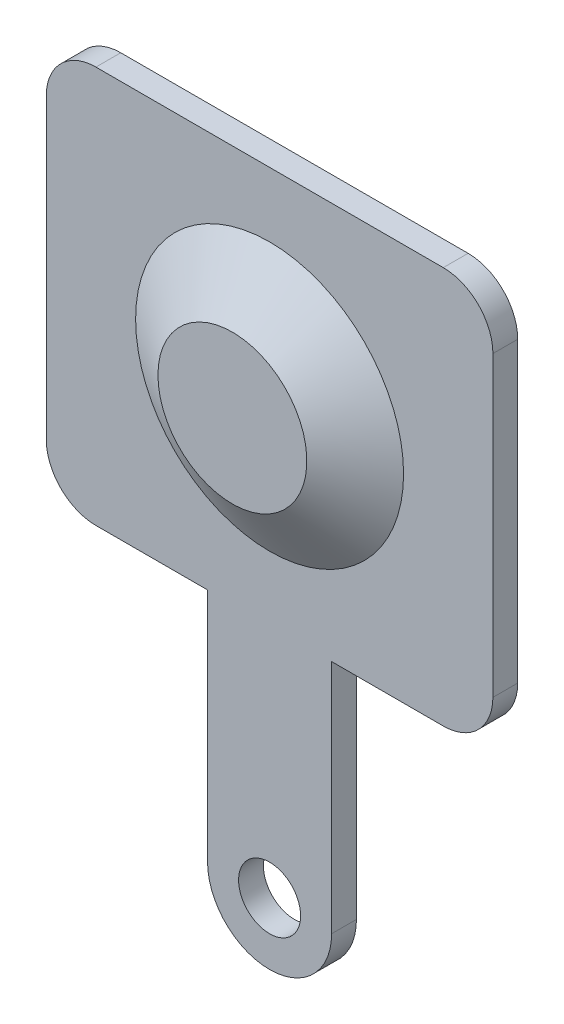
ISO-10303-21;
HEADER;
FILE_DESCRIPTION(('STEP AP214'),'2;1');
FILE_NAME('part.step','',(''),(''),'','','');
FILE_SCHEMA(('AUTOMOTIVE_DESIGN { 1 0 10303 214 1 1 1 1 }'));
ENDSEC;
DATA;
#1=APPLICATION_CONTEXT('core data for automotive mechanical design processes');
#2=APPLICATION_PROTOCOL_DEFINITION('international standard','automotive_design',2000,#1);
#3=PRODUCT_CONTEXT('',#1,'mechanical');
#4=PRODUCT('Part','Part','',(#3));
#5=PRODUCT_RELATED_PRODUCT_CATEGORY('part','',(#4));
#6=PRODUCT_DEFINITION_FORMATION('','',#4);
#7=PRODUCT_DEFINITION_CONTEXT('part definition',#1,'design');
#8=PRODUCT_DEFINITION('design','',#6,#7);
#9=PRODUCT_DEFINITION_SHAPE('','',#8);
#10=(LENGTH_UNIT() NAMED_UNIT(*) SI_UNIT(.MILLI.,.METRE.));
#11=(NAMED_UNIT(*) PLANE_ANGLE_UNIT() SI_UNIT($,.RADIAN.));
#12=(NAMED_UNIT(*) SI_UNIT($,.STERADIAN.) SOLID_ANGLE_UNIT());
#13=UNCERTAINTY_MEASURE_WITH_UNIT(LENGTH_MEASURE(1.E-05),#10,'distance_accuracy_value','');
#14=(GEOMETRIC_REPRESENTATION_CONTEXT(3) GLOBAL_UNCERTAINTY_ASSIGNED_CONTEXT((#13)) GLOBAL_UNIT_ASSIGNED_CONTEXT((#10,
#11,#12)) REPRESENTATION_CONTEXT('',''));
#15=CARTESIAN_POINT('',(0.,0.,0.));
#16=DIRECTION('',(0.,0.,1.));
#17=DIRECTION('',(1.,0.,0.));
#18=AXIS2_PLACEMENT_3D('',#15,#16,#17);
#19=CARTESIAN_POINT('',(-4.5,-4.,0.5));
#20=DIRECTION('',(0.,1.,0.));
#21=DIRECTION('',(0.,0.,1.));
#22=AXIS2_PLACEMENT_3D('',#19,#20,#21);
#23=PLANE('',#22);
#24=DIRECTION('',(1.,0.,0.));
#25=VECTOR('',#24,1.);
#26=CARTESIAN_POINT('',(-4.5,-4.,0.));
#27=LINE('',#26,#25);
#28=CARTESIAN_POINT('',(1.25,-4.,0.));
#29=VERTEX_POINT('',#28);
#30=CARTESIAN_POINT('',(3.5,-4.,0.));
#31=VERTEX_POINT('',#30);
#32=EDGE_CURVE('E184',#29,#31,#27,.T.);
#33=ORIENTED_EDGE('',*,*,#32,.T.);
#34=DIRECTION('',(0.,0.,-1.));
#35=VECTOR('',#34,1.);
#36=CARTESIAN_POINT('',(3.5,-4.,0.5));
#37=LINE('',#36,#35);
#38=CARTESIAN_POINT('',(3.5,-4.,0.5));
#39=VERTEX_POINT('',#38);
#40=EDGE_CURVE('E214',#31,#39,#37,.F.);
#41=ORIENTED_EDGE('',*,*,#40,.T.);
#42=DIRECTION('',(1.,0.,0.));
#43=VECTOR('',#42,1.);
#44=CARTESIAN_POINT('',(-4.5,-4.,0.5));
#45=LINE('',#44,#43);
#46=CARTESIAN_POINT('',(1.25,-4.,0.5));
#47=VERTEX_POINT('',#46);
#48=EDGE_CURVE('E173',#47,#39,#45,.T.);
#49=ORIENTED_EDGE('',*,*,#48,.F.);
#50=DIRECTION('',(0.,0.,1.));
#51=VECTOR('',#50,1.);
#52=CARTESIAN_POINT('',(1.25,-4.,0.5));
#53=LINE('',#52,#51);
#54=EDGE_CURVE('E159',#29,#47,#53,.T.);
#55=ORIENTED_EDGE('',*,*,#54,.F.);
#56=EDGE_LOOP('',(#33,#41,#49,#55));
#57=FACE_BOUND('',#56,.T.);
#58=ADVANCED_FACE('F32',(#57),#23,.F.);
#59=CARTESIAN_POINT('',(-3.5,-4.,0.5));
#60=VERTEX_POINT('',#59);
#61=CARTESIAN_POINT('',(-1.25,-4.,0.5));
#62=VERTEX_POINT('',#61);
#63=EDGE_CURVE('E174',#60,#62,#45,.T.);
#64=ORIENTED_EDGE('',*,*,#63,.F.);
#65=DIRECTION('',(0.,0.,-1.));
#66=VECTOR('',#65,1.);
#67=CARTESIAN_POINT('',(-3.5,-4.,0.5));
#68=LINE('',#67,#66);
#69=CARTESIAN_POINT('',(-3.5,-4.,0.));
#70=VERTEX_POINT('',#69);
#71=EDGE_CURVE('E40',#60,#70,#68,.T.);
#72=ORIENTED_EDGE('',*,*,#71,.T.);
#73=CARTESIAN_POINT('',(-1.25,-4.,0.));
#74=VERTEX_POINT('',#73);
#75=EDGE_CURVE('E167',#70,#74,#27,.T.);
#76=ORIENTED_EDGE('',*,*,#75,.T.);
#77=DIRECTION('',(0.,0.,-1.));
#78=VECTOR('',#77,1.);
#79=CARTESIAN_POINT('',(-1.25,-4.,0.5));
#80=LINE('',#79,#78);
#81=EDGE_CURVE('E131',#62,#74,#80,.T.);
#82=ORIENTED_EDGE('',*,*,#81,.F.);
#83=EDGE_LOOP('',(#64,#72,#76,#82));
#84=FACE_BOUND('',#83,.T.);
#85=ADVANCED_FACE('F219',(#84),#23,.F.);
#86=CARTESIAN_POINT('',(4.5,-4.,0.5));
#87=DIRECTION('',(-1.,0.,0.));
#88=DIRECTION('',(0.,0.,1.));
#89=AXIS2_PLACEMENT_3D('',#86,#87,#88);
#90=PLANE('',#89);
#91=DIRECTION('',(0.,1.,0.));
#92=VECTOR('',#91,1.);
#93=CARTESIAN_POINT('',(4.5,-4.,0.));
#94=LINE('',#93,#92);
#95=CARTESIAN_POINT('',(4.5,-3.,0.));
#96=VERTEX_POINT('',#95);
#97=CARTESIAN_POINT('',(4.5,3.,0.));
#98=VERTEX_POINT('',#97);
#99=EDGE_CURVE('E163',#96,#98,#94,.T.);
#100=ORIENTED_EDGE('',*,*,#99,.T.);
#101=DIRECTION('',(0.,0.,-1.));
#102=VECTOR('',#101,1.);
#103=CARTESIAN_POINT('',(4.5,3.,0.5));
#104=LINE('',#103,#102);
#105=CARTESIAN_POINT('',(4.5,3.,0.5));
#106=VERTEX_POINT('',#105);
#107=EDGE_CURVE('E47',#98,#106,#104,.F.);
#108=ORIENTED_EDGE('',*,*,#107,.T.);
#109=DIRECTION('',(0.,1.,0.));
#110=VECTOR('',#109,1.);
#111=CARTESIAN_POINT('',(4.5,-4.,0.5));
#112=LINE('',#111,#110);
#113=CARTESIAN_POINT('',(4.5,-3.,0.5));
#114=VERTEX_POINT('',#113);
#115=EDGE_CURVE('E164',#114,#106,#112,.T.);
#116=ORIENTED_EDGE('',*,*,#115,.F.);
#117=DIRECTION('',(0.,0.,-1.));
#118=VECTOR('',#117,1.);
#119=CARTESIAN_POINT('',(4.5,-3.,0.5));
#120=LINE('',#119,#118);
#121=EDGE_CURVE('E210',#114,#96,#120,.T.);
#122=ORIENTED_EDGE('',*,*,#121,.T.);
#123=EDGE_LOOP('',(#100,#108,#116,#122));
#124=FACE_BOUND('',#123,.T.);
#125=ADVANCED_FACE('F241',(#124),#90,.F.);
#126=CARTESIAN_POINT('',(-4.5,4.,0.5));
#127=DIRECTION('',(0.,-1.,0.));
#128=DIRECTION('',(0.,0.,-1.));
#129=AXIS2_PLACEMENT_3D('',#126,#127,#128);
#130=PLANE('',#129);
#131=DIRECTION('',(-1.,0.,0.));
#132=VECTOR('',#131,1.);
#133=CARTESIAN_POINT('',(-4.5,4.,0.));
#134=LINE('',#133,#132);
#135=CARTESIAN_POINT('',(3.5,4.,0.));
#136=VERTEX_POINT('',#135);
#137=CARTESIAN_POINT('',(-3.5,4.,0.));
#138=VERTEX_POINT('',#137);
#139=EDGE_CURVE('E178',#136,#138,#134,.T.);
#140=ORIENTED_EDGE('',*,*,#139,.T.);
#141=DIRECTION('',(0.,0.,-1.));
#142=VECTOR('',#141,1.);
#143=CARTESIAN_POINT('',(-3.5,4.,0.5));
#144=LINE('',#143,#142);
#145=CARTESIAN_POINT('',(-3.5,4.,0.5));
#146=VERTEX_POINT('',#145);
#147=EDGE_CURVE('E201',#138,#146,#144,.F.);
#148=ORIENTED_EDGE('',*,*,#147,.T.);
#149=DIRECTION('',(-1.,0.,0.));
#150=VECTOR('',#149,1.);
#151=CARTESIAN_POINT('',(-4.5,4.,0.5));
#152=LINE('',#151,#150);
#153=CARTESIAN_POINT('',(3.5,4.,0.5));
#154=VERTEX_POINT('',#153);
#155=EDGE_CURVE('E166',#154,#146,#152,.T.);
#156=ORIENTED_EDGE('',*,*,#155,.F.);
#157=DIRECTION('',(0.,0.,-1.));
#158=VECTOR('',#157,1.);
#159=CARTESIAN_POINT('',(3.5,4.,0.5));
#160=LINE('',#159,#158);
#161=EDGE_CURVE('E198',#154,#136,#160,.T.);
#162=ORIENTED_EDGE('',*,*,#161,.T.);
#163=EDGE_LOOP('',(#140,#148,#156,#162));
#164=FACE_BOUND('',#163,.T.);
#165=ADVANCED_FACE('F234',(#164),#130,.F.);
#166=CARTESIAN_POINT('',(-4.5,-4.,0.5));
#167=DIRECTION('',(1.,0.,0.));
#168=DIRECTION('',(0.,0.,-1.));
#169=AXIS2_PLACEMENT_3D('',#166,#167,#168);
#170=PLANE('',#169);
#171=DIRECTION('',(0.,-1.,0.));
#172=VECTOR('',#171,1.);
#173=CARTESIAN_POINT('',(-4.5,-4.,0.5));
#174=LINE('',#173,#172);
#175=CARTESIAN_POINT('',(-4.5,3.,0.5));
#176=VERTEX_POINT('',#175);
#177=CARTESIAN_POINT('',(-4.5,-3.,0.5));
#178=VERTEX_POINT('',#177);
#179=EDGE_CURVE('E170',#176,#178,#174,.T.);
#180=ORIENTED_EDGE('',*,*,#179,.F.);
#181=DIRECTION('',(0.,0.,-1.));
#182=VECTOR('',#181,1.);
#183=CARTESIAN_POINT('',(-4.5,3.,0.5));
#184=LINE('',#183,#182);
#185=CARTESIAN_POINT('',(-4.5,3.,0.));
#186=VERTEX_POINT('',#185);
#187=EDGE_CURVE('E187',#176,#186,#184,.T.);
#188=ORIENTED_EDGE('',*,*,#187,.T.);
#189=DIRECTION('',(0.,-1.,0.));
#190=VECTOR('',#189,1.);
#191=CARTESIAN_POINT('',(-4.5,-4.,0.));
#192=LINE('',#191,#190);
#193=CARTESIAN_POINT('',(-4.5,-3.,0.));
#194=VERTEX_POINT('',#193);
#195=EDGE_CURVE('E181',#186,#194,#192,.T.);
#196=ORIENTED_EDGE('',*,*,#195,.T.);
#197=DIRECTION('',(0.,0.,-1.));
#198=VECTOR('',#197,1.);
#199=CARTESIAN_POINT('',(-4.5,-3.,0.5));
#200=LINE('',#199,#198);
#201=EDGE_CURVE('E176',#194,#178,#200,.F.);
#202=ORIENTED_EDGE('',*,*,#201,.T.);
#203=EDGE_LOOP('',(#180,#188,#196,#202));
#204=FACE_BOUND('',#203,.T.);
#205=ADVANCED_FACE('F225',(#204),#170,.F.);
#206=CARTESIAN_POINT('',(0.,0.,0.5));
#207=DIRECTION('',(0.,0.,-1.));
#208=DIRECTION('',(-1.,0.,0.));
#209=AXIS2_PLACEMENT_3D('',#206,#207,#208);
#210=PLANE('',#209);
#211=CARTESIAN_POINT('',(0.,0.,0.5));
#212=DIRECTION('',(0.,0.,-1.));
#213=DIRECTION('',(-1.,0.,0.));
#214=AXIS2_PLACEMENT_3D('',#211,#212,#213);
#215=CIRCLE('',#214,2.7);
#216=CARTESIAN_POINT('',(-2.7,0.,0.5));
#217=VERTEX_POINT('',#216);
#218=EDGE_CURVE('E11',#217,#217,#215,.F.);
#219=ORIENTED_EDGE('',*,*,#218,.F.);
#220=EDGE_LOOP('',(#219));
#221=FACE_BOUND('',#220,.T.);
#222=CARTESIAN_POINT('',(0.,-8.75,0.5));
#223=DIRECTION('',(0.,0.,1.));
#224=DIRECTION('',(1.,0.,0.));
#225=AXIS2_PLACEMENT_3D('',#222,#223,#224);
#226=CIRCLE('',#225,0.625);
#227=CARTESIAN_POINT('',(0.625000000000001,-8.75,0.5));
#228=VERTEX_POINT('',#227);
#229=EDGE_CURVE('E254',#228,#228,#226,.T.);
#230=ORIENTED_EDGE('',*,*,#229,.F.);
#231=EDGE_LOOP('',(#230));
#232=FACE_BOUND('',#231,.T.);
#233=ORIENTED_EDGE('',*,*,#155,.T.);
#234=CARTESIAN_POINT('',(-3.5,3.,0.5));
#235=DIRECTION('',(0.,0.,-1.));
#236=DIRECTION('',(-1.,0.,0.));
#237=AXIS2_PLACEMENT_3D('',#234,#235,#236);
#238=CIRCLE('',#237,1.);
#239=EDGE_CURVE('E208',#146,#176,#238,.F.);
#240=ORIENTED_EDGE('',*,*,#239,.T.);
#241=ORIENTED_EDGE('',*,*,#179,.T.);
#242=CARTESIAN_POINT('',(-3.5,-3.,0.5));
#243=DIRECTION('',(0.,0.,-1.));
#244=DIRECTION('',(-1.,0.,0.));
#245=AXIS2_PLACEMENT_3D('',#242,#243,#244);
#246=CIRCLE('',#245,1.);
#247=EDGE_CURVE('E203',#178,#60,#246,.F.);
#248=ORIENTED_EDGE('',*,*,#247,.T.);
#249=ORIENTED_EDGE('',*,*,#63,.T.);
#250=DIRECTION('',(0.,1.,0.));
#251=VECTOR('',#250,1.);
#252=CARTESIAN_POINT('',(-1.25,0.,0.5));
#253=LINE('',#252,#251);
#254=CARTESIAN_POINT('',(-1.25,-8.75,0.5));
#255=VERTEX_POINT('',#254);
#256=EDGE_CURVE('E160',#255,#62,#253,.T.);
#257=ORIENTED_EDGE('',*,*,#256,.F.);
#258=CARTESIAN_POINT('',(0.,-8.75,0.5));
#259=DIRECTION('',(0.,0.,-1.));
#260=DIRECTION('',(-1.,0.,0.));
#261=AXIS2_PLACEMENT_3D('',#258,#259,#260);
#262=CIRCLE('',#261,1.25);
#263=CARTESIAN_POINT('',(1.25,-8.75,0.5));
#264=VERTEX_POINT('',#263);
#265=EDGE_CURVE('E144',#264,#255,#262,.T.);
#266=ORIENTED_EDGE('',*,*,#265,.F.);
#267=DIRECTION('',(0.,-1.,0.));
#268=VECTOR('',#267,1.);
#269=CARTESIAN_POINT('',(1.25,0.,0.5));
#270=LINE('',#269,#268);
#271=EDGE_CURVE('E145',#47,#264,#270,.T.);
#272=ORIENTED_EDGE('',*,*,#271,.F.);
#273=ORIENTED_EDGE('',*,*,#48,.T.);
#274=CARTESIAN_POINT('',(3.5,-3.,0.5));
#275=DIRECTION('',(0.,0.,-1.));
#276=DIRECTION('',(-1.,0.,0.));
#277=AXIS2_PLACEMENT_3D('',#274,#275,#276);
#278=CIRCLE('',#277,1.);
#279=EDGE_CURVE('E54',#39,#114,#278,.F.);
#280=ORIENTED_EDGE('',*,*,#279,.T.);
#281=ORIENTED_EDGE('',*,*,#115,.T.);
#282=CARTESIAN_POINT('',(3.5,3.,0.5));
#283=DIRECTION('',(0.,0.,-1.));
#284=DIRECTION('',(-1.,0.,0.));
#285=AXIS2_PLACEMENT_3D('',#282,#283,#284);
#286=CIRCLE('',#285,1.);
#287=EDGE_CURVE('E206',#106,#154,#286,.F.);
#288=ORIENTED_EDGE('',*,*,#287,.T.);
#289=EDGE_LOOP('',(#233,#240,#241,#248,#249,#257,#266,#272,#273,#280,#281,#288));
#290=FACE_BOUND('',#289,.T.);
#291=ADVANCED_FACE('F227',(#221,#232,#290),#210,.F.);
#292=CARTESIAN_POINT('',(0.,0.,0.));
#293=DIRECTION('',(0.,0.,-1.));
#294=DIRECTION('',(-1.,0.,0.));
#295=AXIS2_PLACEMENT_3D('',#292,#293,#294);
#296=PLANE('',#295);
#297=CARTESIAN_POINT('',(0.,0.,0.));
#298=DIRECTION('',(0.,0.,-1.));
#299=DIRECTION('',(-1.,0.,0.));
#300=AXIS2_PLACEMENT_3D('',#297,#298,#299);
#301=CIRCLE('',#300,2.55660188679434);
#302=CARTESIAN_POINT('',(-2.55660188679434,0.,0.));
#303=VERTEX_POINT('',#302);
#304=EDGE_CURVE('E262',#303,#303,#301,.F.);
#305=ORIENTED_EDGE('',*,*,#304,.T.);
#306=EDGE_LOOP('',(#305));
#307=FACE_BOUND('',#306,.T.);
#308=CARTESIAN_POINT('',(0.,-8.75,0.));
#309=DIRECTION('',(0.,0.,1.));
#310=DIRECTION('',(1.,0.,0.));
#311=AXIS2_PLACEMENT_3D('',#308,#309,#310);
#312=CIRCLE('',#311,0.625);
#313=CARTESIAN_POINT('',(0.625000000000001,-8.75,0.));
#314=VERTEX_POINT('',#313);
#315=EDGE_CURVE('E136',#314,#314,#312,.T.);
#316=ORIENTED_EDGE('',*,*,#315,.T.);
#317=EDGE_LOOP('',(#316));
#318=FACE_BOUND('',#317,.T.);
#319=ORIENTED_EDGE('',*,*,#195,.F.);
#320=CARTESIAN_POINT('',(-3.5,3.,0.));
#321=DIRECTION('',(0.,0.,-1.));
#322=DIRECTION('',(-1.,0.,0.));
#323=AXIS2_PLACEMENT_3D('',#320,#321,#322);
#324=CIRCLE('',#323,1.);
#325=EDGE_CURVE('E196',#186,#138,#324,.T.);
#326=ORIENTED_EDGE('',*,*,#325,.T.);
#327=ORIENTED_EDGE('',*,*,#139,.F.);
#328=CARTESIAN_POINT('',(3.5,3.,0.));
#329=DIRECTION('',(0.,0.,-1.));
#330=DIRECTION('',(-1.,0.,0.));
#331=AXIS2_PLACEMENT_3D('',#328,#329,#330);
#332=CIRCLE('',#331,1.);
#333=EDGE_CURVE('E194',#136,#98,#332,.T.);
#334=ORIENTED_EDGE('',*,*,#333,.T.);
#335=ORIENTED_EDGE('',*,*,#99,.F.);
#336=CARTESIAN_POINT('',(3.5,-3.,0.));
#337=DIRECTION('',(0.,0.,-1.));
#338=DIRECTION('',(-1.,0.,0.));
#339=AXIS2_PLACEMENT_3D('',#336,#337,#338);
#340=CIRCLE('',#339,1.);
#341=EDGE_CURVE('E192',#96,#31,#340,.T.);
#342=ORIENTED_EDGE('',*,*,#341,.T.);
#343=ORIENTED_EDGE('',*,*,#32,.F.);
#344=DIRECTION('',(0.,1.,0.));
#345=VECTOR('',#344,1.);
#346=CARTESIAN_POINT('',(1.25,0.,0.));
#347=LINE('',#346,#345);
#348=CARTESIAN_POINT('',(1.25,-8.75,0.));
#349=VERTEX_POINT('',#348);
#350=EDGE_CURVE('E151',#349,#29,#347,.T.);
#351=ORIENTED_EDGE('',*,*,#350,.F.);
#352=CARTESIAN_POINT('',(0.,-8.75,0.));
#353=DIRECTION('',(0.,0.,1.));
#354=DIRECTION('',(1.,0.,0.));
#355=AXIS2_PLACEMENT_3D('',#352,#353,#354);
#356=CIRCLE('',#355,1.25);
#357=CARTESIAN_POINT('',(-1.25,-8.75,0.));
#358=VERTEX_POINT('',#357);
#359=EDGE_CURVE('E135',#358,#349,#356,.T.);
#360=ORIENTED_EDGE('',*,*,#359,.F.);
#361=DIRECTION('',(0.,-1.,0.));
#362=VECTOR('',#361,1.);
#363=CARTESIAN_POINT('',(-1.25,0.,0.));
#364=LINE('',#363,#362);
#365=EDGE_CURVE('E124',#74,#358,#364,.T.);
#366=ORIENTED_EDGE('',*,*,#365,.F.);
#367=ORIENTED_EDGE('',*,*,#75,.F.);
#368=CARTESIAN_POINT('',(-3.5,-3.,0.));
#369=DIRECTION('',(0.,0.,-1.));
#370=DIRECTION('',(-1.,0.,0.));
#371=AXIS2_PLACEMENT_3D('',#368,#369,#370);
#372=CIRCLE('',#371,1.);
#373=EDGE_CURVE('E190',#70,#194,#372,.T.);
#374=ORIENTED_EDGE('',*,*,#373,.T.);
#375=EDGE_LOOP('',(#319,#326,#327,#334,#335,#342,#343,#351,#360,#366,#367,#374));
#376=FACE_BOUND('',#375,.T.);
#377=ADVANCED_FACE('F149',(#307,#318,#376),#296,.T.);
#378=CARTESIAN_POINT('',(1.25,0.,12.0244305716161));
#379=DIRECTION('',(-1.,0.,0.));
#380=DIRECTION('',(0.,-1.,0.));
#381=AXIS2_PLACEMENT_3D('',#378,#379,#380);
#382=PLANE('',#381);
#383=ORIENTED_EDGE('',*,*,#350,.T.);
#384=ORIENTED_EDGE('',*,*,#54,.T.);
#385=ORIENTED_EDGE('',*,*,#271,.T.);
#386=DIRECTION('',(0.,0.,-1.));
#387=VECTOR('',#386,1.);
#388=CARTESIAN_POINT('',(1.25,-8.75,12.0244305716161));
#389=LINE('',#388,#387);
#390=EDGE_CURVE('E146',#264,#349,#389,.T.);
#391=ORIENTED_EDGE('',*,*,#390,.T.);
#392=EDGE_LOOP('',(#383,#384,#385,#391));
#393=FACE_BOUND('',#392,.T.);
#394=ADVANCED_FACE('F251',(#393),#382,.F.);
#395=CARTESIAN_POINT('',(-1.25,0.,12.0244305716161));
#396=DIRECTION('',(1.,0.,0.));
#397=DIRECTION('',(0.,1.,0.));
#398=AXIS2_PLACEMENT_3D('',#395,#396,#397);
#399=PLANE('',#398);
#400=ORIENTED_EDGE('',*,*,#256,.T.);
#401=ORIENTED_EDGE('',*,*,#81,.T.);
#402=ORIENTED_EDGE('',*,*,#365,.T.);
#403=DIRECTION('',(0.,0.,-1.));
#404=VECTOR('',#403,1.);
#405=CARTESIAN_POINT('',(-1.25,-8.75,12.0244305716161));
#406=LINE('',#405,#404);
#407=EDGE_CURVE('E128',#255,#358,#406,.T.);
#408=ORIENTED_EDGE('',*,*,#407,.F.);
#409=EDGE_LOOP('',(#400,#401,#402,#408));
#410=FACE_BOUND('',#409,.T.);
#411=ADVANCED_FACE('F127',(#410),#399,.F.);
#412=CARTESIAN_POINT('',(0.,-8.75,12.0244305716161));
#413=DIRECTION('',(0.,0.,-1.));
#414=DIRECTION('',(-1.,0.,0.));
#415=AXIS2_PLACEMENT_3D('',#412,#413,#414);
#416=CYLINDRICAL_SURFACE('',#415,1.25);
#417=ORIENTED_EDGE('',*,*,#390,.F.);
#418=ORIENTED_EDGE('',*,*,#265,.T.);
#419=ORIENTED_EDGE('',*,*,#407,.T.);
#420=ORIENTED_EDGE('',*,*,#359,.T.);
#421=EDGE_LOOP('',(#417,#418,#419,#420));
#422=FACE_BOUND('',#421,.T.);
#423=ADVANCED_FACE('F141',(#422),#416,.T.);
#424=CARTESIAN_POINT('',(-3.5,3.,0.5));
#425=DIRECTION('',(0.,0.,-1.));
#426=DIRECTION('',(-1.,0.,0.));
#427=AXIS2_PLACEMENT_3D('',#424,#425,#426);
#428=CYLINDRICAL_SURFACE('',#427,1.);
#429=ORIENTED_EDGE('',*,*,#239,.F.);
#430=ORIENTED_EDGE('',*,*,#147,.F.);
#431=ORIENTED_EDGE('',*,*,#325,.F.);
#432=ORIENTED_EDGE('',*,*,#187,.F.);
#433=EDGE_LOOP('',(#429,#430,#431,#432));
#434=FACE_BOUND('',#433,.T.);
#435=ADVANCED_FACE('F230',(#434),#428,.T.);
#436=CARTESIAN_POINT('',(3.5,3.,0.5));
#437=DIRECTION('',(0.,0.,-1.));
#438=DIRECTION('',(-1.,0.,0.));
#439=AXIS2_PLACEMENT_3D('',#436,#437,#438);
#440=CYLINDRICAL_SURFACE('',#439,1.);
#441=ORIENTED_EDGE('',*,*,#287,.F.);
#442=ORIENTED_EDGE('',*,*,#107,.F.);
#443=ORIENTED_EDGE('',*,*,#333,.F.);
#444=ORIENTED_EDGE('',*,*,#161,.F.);
#445=EDGE_LOOP('',(#441,#442,#443,#444));
#446=FACE_BOUND('',#445,.T.);
#447=ADVANCED_FACE('F239',(#446),#440,.T.);
#448=CARTESIAN_POINT('',(3.5,-3.,0.5));
#449=DIRECTION('',(0.,0.,-1.));
#450=DIRECTION('',(-1.,0.,0.));
#451=AXIS2_PLACEMENT_3D('',#448,#449,#450);
#452=CYLINDRICAL_SURFACE('',#451,1.);
#453=ORIENTED_EDGE('',*,*,#279,.F.);
#454=ORIENTED_EDGE('',*,*,#40,.F.);
#455=ORIENTED_EDGE('',*,*,#341,.F.);
#456=ORIENTED_EDGE('',*,*,#121,.F.);
#457=EDGE_LOOP('',(#453,#454,#455,#456));
#458=FACE_BOUND('',#457,.T.);
#459=ADVANCED_FACE('F244',(#458),#452,.T.);
#460=CARTESIAN_POINT('',(-3.5,-3.,0.5));
#461=DIRECTION('',(0.,0.,-1.));
#462=DIRECTION('',(-1.,0.,0.));
#463=AXIS2_PLACEMENT_3D('',#460,#461,#462);
#464=CYLINDRICAL_SURFACE('',#463,1.);
#465=ORIENTED_EDGE('',*,*,#247,.F.);
#466=ORIENTED_EDGE('',*,*,#201,.F.);
#467=ORIENTED_EDGE('',*,*,#373,.F.);
#468=ORIENTED_EDGE('',*,*,#71,.F.);
#469=EDGE_LOOP('',(#465,#466,#467,#468));
#470=FACE_BOUND('',#469,.T.);
#471=ADVANCED_FACE('F34',(#470),#464,.T.);
#472=CARTESIAN_POINT('',(0.,-8.75,0.));
#473=DIRECTION('',(0.,0.,1.));
#474=DIRECTION('',(1.,0.,0.));
#475=AXIS2_PLACEMENT_3D('',#472,#473,#474);
#476=CYLINDRICAL_SURFACE('',#475,0.625);
#477=ORIENTED_EDGE('',*,*,#315,.F.);
#478=EDGE_LOOP('',(#477));
#479=FACE_BOUND('',#478,.T.);
#480=ORIENTED_EDGE('',*,*,#229,.T.);
#481=EDGE_LOOP('',(#480));
#482=FACE_BOUND('',#481,.T.);
#483=ADVANCED_FACE('F305',(#479,#482),#476,.F.);
#484=CARTESIAN_POINT('',(0.,0.,1.25));
#485=DIRECTION('',(0.,0.,-1.));
#486=DIRECTION('',(-1.,0.,0.));
#487=AXIS2_PLACEMENT_3D('',#484,#485,#486);
#488=CONICAL_SURFACE('',#487,1.5,1.01219701145133);
#489=ORIENTED_EDGE('',*,*,#218,.T.);
#490=EDGE_LOOP('',(#489));
#491=FACE_BOUND('',#490,.T.);
#492=CARTESIAN_POINT('',(0.,0.,1.25));
#493=DIRECTION('',(0.,0.,-1.));
#494=DIRECTION('',(-1.,0.,0.));
#495=AXIS2_PLACEMENT_3D('',#492,#493,#494);
#496=CIRCLE('',#495,1.5);
#497=CARTESIAN_POINT('',(-1.5,0.,1.25));
#498=VERTEX_POINT('',#497);
#499=EDGE_CURVE('E257',#498,#498,#496,.T.);
#500=ORIENTED_EDGE('',*,*,#499,.T.);
#501=EDGE_LOOP('',(#500));
#502=FACE_BOUND('',#501,.T.);
#503=ADVANCED_FACE('F309',(#491,#502),#488,.T.);
#504=CARTESIAN_POINT('',(1.5,0.,1.25));
#505=DIRECTION('',(0.,0.,-1.));
#506=DIRECTION('',(-1.,0.,0.));
#507=AXIS2_PLACEMENT_3D('',#504,#505,#506);
#508=PLANE('',#507);
#509=ORIENTED_EDGE('',*,*,#499,.F.);
#510=EDGE_LOOP('',(#509));
#511=FACE_BOUND('',#510,.T.);
#512=ADVANCED_FACE('F275',(#511),#508,.F.);
#513=CARTESIAN_POINT('',(0.,0.,0.826000847997457));
#514=DIRECTION('',(0.,0.,-1.));
#515=DIRECTION('',(-1.,0.,0.));
#516=AXIS2_PLACEMENT_3D('',#513,#514,#515);
#517=CONICAL_SURFACE('',#516,1.23500052999841,1.01219701145133);
#518=ORIENTED_EDGE('',*,*,#304,.F.);
#519=EDGE_LOOP('',(#518));
#520=FACE_BOUND('',#519,.T.);
#521=CARTESIAN_POINT('',(0.,0.,0.749999999999999));
#522=DIRECTION('',(0.,0.,-1.));
#523=DIRECTION('',(-1.,0.,0.));
#524=AXIS2_PLACEMENT_3D('',#521,#522,#523);
#525=CIRCLE('',#524,1.35660188679434);
#526=CARTESIAN_POINT('',(-1.35660188679434,0.,0.749999999999999));
#527=VERTEX_POINT('',#526);
#528=EDGE_CURVE('E263',#527,#527,#525,.T.);
#529=ORIENTED_EDGE('',*,*,#528,.F.);
#530=EDGE_LOOP('',(#529));
#531=FACE_BOUND('',#530,.T.);
#532=ADVANCED_FACE('F271',(#520,#531),#517,.F.);
#533=CARTESIAN_POINT('',(1.5,0.,0.749999999999999));
#534=DIRECTION('',(0.,0.,-1.));
#535=DIRECTION('',(-1.,0.,0.));
#536=AXIS2_PLACEMENT_3D('',#533,#534,#535);
#537=PLANE('',#536);
#538=ORIENTED_EDGE('',*,*,#528,.T.);
#539=EDGE_LOOP('',(#538));
#540=FACE_BOUND('',#539,.T.);
#541=ADVANCED_FACE('F274',(#540),#537,.T.);
#542=CLOSED_SHELL('',(#58,#85,#125,#165,#205,#291,#377,#394,#411,#423,#435,#447,#459,#471,#483,
#503,#512,#532,#541));
#543=MANIFOLD_SOLID_BREP('B2',#542);
#544=ADVANCED_BREP_SHAPE_REPRESENTATION('',(#18,#543),#14);
#545=SHAPE_DEFINITION_REPRESENTATION(#9,#544);
ENDSEC;
END-ISO-10303-21;
